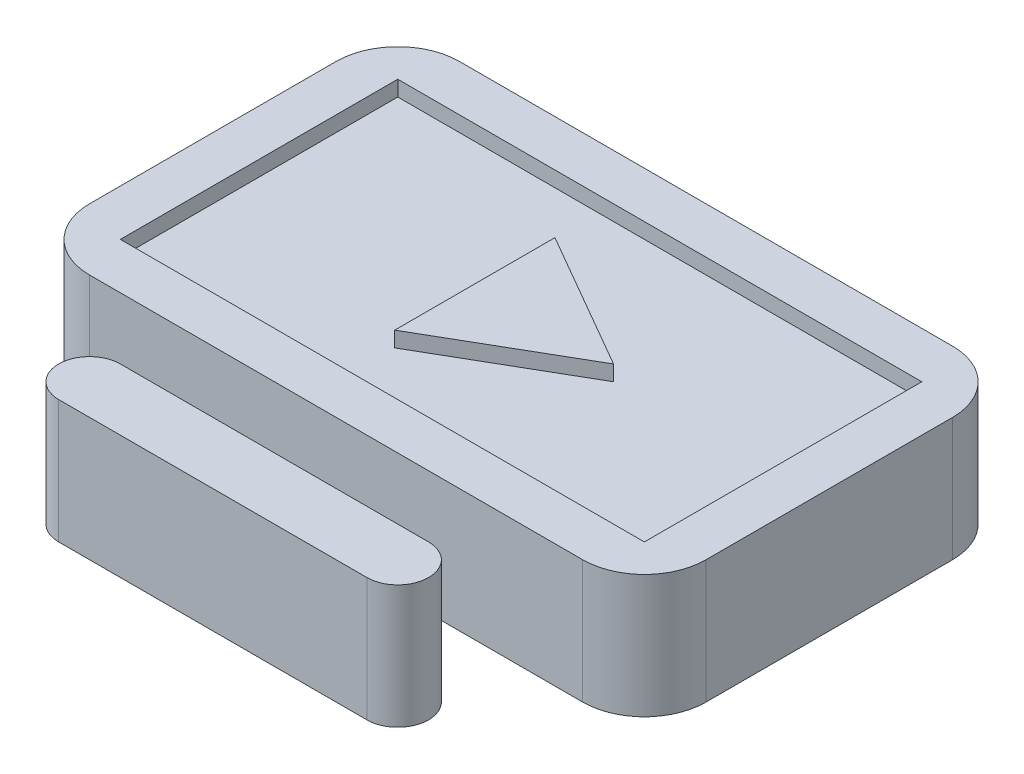
ISO-10303-21;
HEADER;
FILE_DESCRIPTION(('STEP AP214'),'2;1');
FILE_NAME('part.step','',(''),(''),'','','');
FILE_SCHEMA(('AUTOMOTIVE_DESIGN { 1 0 10303 214 1 1 1 1 }'));
ENDSEC;
DATA;
#1=APPLICATION_CONTEXT('core data for automotive mechanical design processes');
#2=APPLICATION_PROTOCOL_DEFINITION('international standard','automotive_design',2000,#1);
#3=PRODUCT_CONTEXT('',#1,'mechanical');
#4=PRODUCT('Part','Part','',(#3));
#5=PRODUCT_RELATED_PRODUCT_CATEGORY('part','',(#4));
#6=PRODUCT_DEFINITION_FORMATION('','',#4);
#7=PRODUCT_DEFINITION_CONTEXT('part definition',#1,'design');
#8=PRODUCT_DEFINITION('design','',#6,#7);
#9=PRODUCT_DEFINITION_SHAPE('','',#8);
#10=(LENGTH_UNIT() NAMED_UNIT(*) SI_UNIT(.MILLI.,.METRE.));
#11=(NAMED_UNIT(*) PLANE_ANGLE_UNIT() SI_UNIT($,.RADIAN.));
#12=(NAMED_UNIT(*) SI_UNIT($,.STERADIAN.) SOLID_ANGLE_UNIT());
#13=UNCERTAINTY_MEASURE_WITH_UNIT(LENGTH_MEASURE(1.E-05),#10,'distance_accuracy_value','');
#14=(GEOMETRIC_REPRESENTATION_CONTEXT(3) GLOBAL_UNCERTAINTY_ASSIGNED_CONTEXT((#13)) GLOBAL_UNIT_ASSIGNED_CONTEXT((#10,
#11,#12)) REPRESENTATION_CONTEXT('',''));
#15=CARTESIAN_POINT('',(0.,0.,0.));
#16=DIRECTION('',(0.,0.,1.));
#17=DIRECTION('',(1.,0.,0.));
#18=AXIS2_PLACEMENT_3D('',#15,#16,#17);
#19=CARTESIAN_POINT('',(-12.7,50.8,0.));
#20=DIRECTION('',(-1.,0.,0.));
#21=DIRECTION('',(0.,0.,1.));
#22=AXIS2_PLACEMENT_3D('',#19,#20,#21);
#23=PLANE('',#22);
#24=DIRECTION('',(0.,-1.,0.));
#25=VECTOR('',#24,1.);
#26=CARTESIAN_POINT('',(-12.7,50.8,-12.7));
#27=LINE('',#26,#25);
#28=CARTESIAN_POINT('',(-12.7,25.4,-12.7));
#29=VERTEX_POINT('',#28);
#30=CARTESIAN_POINT('',(-12.7,0.,-12.7));
#31=VERTEX_POINT('',#30);
#32=EDGE_CURVE('E190',#29,#31,#27,.T.);
#33=ORIENTED_EDGE('',*,*,#32,.F.);
#34=DIRECTION('',(0.,0.,1.));
#35=VECTOR('',#34,1.);
#36=CARTESIAN_POINT('',(-12.7,25.4,-38.1));
#37=LINE('',#36,#35);
#38=CARTESIAN_POINT('',(-12.7,25.4,-38.1));
#39=VERTEX_POINT('',#38);
#40=EDGE_CURVE('E196',#39,#29,#37,.T.);
#41=ORIENTED_EDGE('',*,*,#40,.F.);
#42=DIRECTION('',(0.,-1.,0.));
#43=VECTOR('',#42,1.);
#44=CARTESIAN_POINT('',(-12.7,50.8,-38.1));
#45=LINE('',#44,#43);
#46=CARTESIAN_POINT('',(-12.7,0.,-38.1));
#47=VERTEX_POINT('',#46);
#48=EDGE_CURVE('E208',#39,#47,#45,.T.);
#49=ORIENTED_EDGE('',*,*,#48,.T.);
#50=DIRECTION('',(0.,0.,-1.));
#51=VECTOR('',#50,1.);
#52=CARTESIAN_POINT('',(-12.7,0.,0.));
#53=LINE('',#52,#51);
#54=EDGE_CURVE('E206',#31,#47,#53,.T.);
#55=ORIENTED_EDGE('',*,*,#54,.F.);
#56=EDGE_LOOP('',(#33,#41,#49,#55));
#57=FACE_BOUND('',#56,.T.);
#58=ADVANCED_FACE('F32',(#57),#23,.T.);
#59=CARTESIAN_POINT('',(12.7,50.8,0.));
#60=DIRECTION('',(-1.,0.,0.));
#61=DIRECTION('',(0.,0.,1.));
#62=AXIS2_PLACEMENT_3D('',#59,#60,#61);
#63=PLANE('',#62);
#64=DIRECTION('',(0.,0.,-1.));
#65=VECTOR('',#64,1.);
#66=CARTESIAN_POINT('',(12.7,25.4,-38.1));
#67=LINE('',#66,#65);
#68=CARTESIAN_POINT('',(12.7,25.4,-12.7));
#69=VERTEX_POINT('',#68);
#70=CARTESIAN_POINT('',(12.7,25.4,-38.1));
#71=VERTEX_POINT('',#70);
#72=EDGE_CURVE('E195',#69,#71,#67,.T.);
#73=ORIENTED_EDGE('',*,*,#72,.F.);
#74=DIRECTION('',(0.,-1.,0.));
#75=VECTOR('',#74,1.);
#76=CARTESIAN_POINT('',(12.7,50.8,-12.7));
#77=LINE('',#76,#75);
#78=CARTESIAN_POINT('',(12.7,0.,-12.7));
#79=VERTEX_POINT('',#78);
#80=EDGE_CURVE('E192',#69,#79,#77,.T.);
#81=ORIENTED_EDGE('',*,*,#80,.T.);
#82=DIRECTION('',(0.,0.,-1.));
#83=VECTOR('',#82,1.);
#84=CARTESIAN_POINT('',(12.7,0.,0.));
#85=LINE('',#84,#83);
#86=CARTESIAN_POINT('',(12.7,0.,-38.1));
#87=VERTEX_POINT('',#86);
#88=EDGE_CURVE('E289',#79,#87,#85,.T.);
#89=ORIENTED_EDGE('',*,*,#88,.T.);
#90=DIRECTION('',(0.,-1.,0.));
#91=VECTOR('',#90,1.);
#92=CARTESIAN_POINT('',(12.7,50.8,-38.1));
#93=LINE('',#92,#91);
#94=EDGE_CURVE('E292',#71,#87,#93,.T.);
#95=ORIENTED_EDGE('',*,*,#94,.F.);
#96=EDGE_LOOP('',(#73,#81,#89,#95));
#97=FACE_BOUND('',#96,.T.);
#98=ADVANCED_FACE('F395',(#97),#63,.F.);
#99=CARTESIAN_POINT('',(0.,50.8,0.));
#100=DIRECTION('',(0.,1.,0.));
#101=DIRECTION('',(0.,0.,1.));
#102=AXIS2_PLACEMENT_3D('',#99,#100,#101);
#103=PLANE('',#102);
#104=CARTESIAN_POINT('',(-101.6,50.8,-63.5));
#105=DIRECTION('',(0.,1.,0.));
#106=DIRECTION('',(0.,0.,1.));
#107=AXIS2_PLACEMENT_3D('',#104,#105,#106);
#108=CIRCLE('',#107,25.4);
#109=CARTESIAN_POINT('',(-127.,50.8,-63.5));
#110=VERTEX_POINT('',#109);
#111=CARTESIAN_POINT('',(-101.6,50.8,-38.1));
#112=VERTEX_POINT('',#111);
#113=EDGE_CURVE('E235',#110,#112,#108,.T.);
#114=ORIENTED_EDGE('',*,*,#113,.T.);
#115=DIRECTION('',(1.,0.,0.));
#116=VECTOR('',#115,1.);
#117=CARTESIAN_POINT('',(0.,50.8,-38.1));
#118=LINE('',#117,#116);
#119=CARTESIAN_POINT('',(101.6,50.8,-38.1));
#120=VERTEX_POINT('',#119);
#121=EDGE_CURVE('E294',#112,#120,#118,.T.);
#122=ORIENTED_EDGE('',*,*,#121,.T.);
#123=CARTESIAN_POINT('',(101.6,50.8,-63.5));
#124=DIRECTION('',(0.,1.,0.));
#125=DIRECTION('',(0.,0.,1.));
#126=AXIS2_PLACEMENT_3D('',#123,#124,#125);
#127=CIRCLE('',#126,25.4);
#128=CARTESIAN_POINT('',(127.,50.8,-63.5));
#129=VERTEX_POINT('',#128);
#130=EDGE_CURVE('E238',#120,#129,#127,.T.);
#131=ORIENTED_EDGE('',*,*,#130,.T.);
#132=DIRECTION('',(0.,0.,1.));
#133=VECTOR('',#132,1.);
#134=CARTESIAN_POINT('',(127.,50.8,0.));
#135=LINE('',#134,#133);
#136=CARTESIAN_POINT('',(127.,50.8,-165.1));
#137=VERTEX_POINT('',#136);
#138=EDGE_CURVE('E334',#137,#129,#135,.T.);
#139=ORIENTED_EDGE('',*,*,#138,.F.);
#140=CARTESIAN_POINT('',(101.6,50.8,-165.1));
#141=DIRECTION('',(0.,1.,0.));
#142=DIRECTION('',(0.,0.,1.));
#143=AXIS2_PLACEMENT_3D('',#140,#141,#142);
#144=CIRCLE('',#143,25.4);
#145=CARTESIAN_POINT('',(101.6,50.8,-190.5));
#146=VERTEX_POINT('',#145);
#147=EDGE_CURVE('E231',#137,#146,#144,.T.);
#148=ORIENTED_EDGE('',*,*,#147,.T.);
#149=DIRECTION('',(1.,0.,0.));
#150=VECTOR('',#149,1.);
#151=CARTESIAN_POINT('',(1.04083408558608E-13,50.8,-190.5));
#152=LINE('',#151,#150);
#153=CARTESIAN_POINT('',(-101.6,50.8,-190.5));
#154=VERTEX_POINT('',#153);
#155=EDGE_CURVE('E257',#154,#146,#152,.T.);
#156=ORIENTED_EDGE('',*,*,#155,.F.);
#157=CARTESIAN_POINT('',(-101.6,50.8,-165.1));
#158=DIRECTION('',(0.,1.,0.));
#159=DIRECTION('',(0.,0.,1.));
#160=AXIS2_PLACEMENT_3D('',#157,#158,#159);
#161=CIRCLE('',#160,25.4);
#162=CARTESIAN_POINT('',(-127.,50.8,-165.1));
#163=VERTEX_POINT('',#162);
#164=EDGE_CURVE('E233',#154,#163,#161,.T.);
#165=ORIENTED_EDGE('',*,*,#164,.T.);
#166=DIRECTION('',(0.,0.,1.));
#167=VECTOR('',#166,1.);
#168=CARTESIAN_POINT('',(-127.,50.8,0.));
#169=LINE('',#168,#167);
#170=EDGE_CURVE('E329',#163,#110,#169,.T.);
#171=ORIENTED_EDGE('',*,*,#170,.T.);
#172=EDGE_LOOP('',(#114,#122,#131,#139,#148,#156,#165,#171));
#173=FACE_BOUND('',#172,.T.);
#174=DIRECTION('',(0.,0.,-1.));
#175=VECTOR('',#174,1.);
#176=CARTESIAN_POINT('',(107.95,50.8,-57.1499999999999));
#177=LINE('',#176,#175);
#178=CARTESIAN_POINT('',(107.95,50.8,-57.1499999999999));
#179=VERTEX_POINT('',#178);
#180=CARTESIAN_POINT('',(107.95,50.8,-171.45));
#181=VERTEX_POINT('',#180);
#182=EDGE_CURVE('E356',#179,#181,#177,.T.);
#183=ORIENTED_EDGE('',*,*,#182,.F.);
#184=DIRECTION('',(1.,0.,0.));
#185=VECTOR('',#184,1.);
#186=CARTESIAN_POINT('',(-107.95,50.8,-57.1499999999999));
#187=LINE('',#186,#185);
#188=CARTESIAN_POINT('',(-107.95,50.8,-57.1499999999999));
#189=VERTEX_POINT('',#188);
#190=EDGE_CURVE('E346',#189,#179,#187,.T.);
#191=ORIENTED_EDGE('',*,*,#190,.F.);
#192=DIRECTION('',(0.,0.,1.));
#193=VECTOR('',#192,1.);
#194=CARTESIAN_POINT('',(-107.95,50.8,-57.1499999999999));
#195=LINE('',#194,#193);
#196=CARTESIAN_POINT('',(-107.95,50.8,-171.45));
#197=VERTEX_POINT('',#196);
#198=EDGE_CURVE('E350',#197,#189,#195,.T.);
#199=ORIENTED_EDGE('',*,*,#198,.F.);
#200=DIRECTION('',(-1.,0.,0.));
#201=VECTOR('',#200,1.);
#202=CARTESIAN_POINT('',(-107.95,50.8,-171.45));
#203=LINE('',#202,#201);
#204=EDGE_CURVE('E353',#181,#197,#203,.T.);
#205=ORIENTED_EDGE('',*,*,#204,.F.);
#206=EDGE_LOOP('',(#183,#191,#199,#205));
#207=FACE_BOUND('',#206,.T.);
#208=ADVANCED_FACE('F404',(#173,#207),#103,.T.);
#209=CARTESIAN_POINT('',(0.,44.45,0.));
#210=DIRECTION('',(0.,-1.,0.));
#211=DIRECTION('',(0.,0.,-1.));
#212=AXIS2_PLACEMENT_3D('',#209,#210,#211);
#213=PLANE('',#212);
#214=DIRECTION('',(0.,0.,-1.));
#215=VECTOR('',#214,1.);
#216=CARTESIAN_POINT('',(107.95,44.45,-57.1499999999999));
#217=LINE('',#216,#215);
#218=CARTESIAN_POINT('',(107.95,44.45,-57.1499999999999));
#219=VERTEX_POINT('',#218);
#220=CARTESIAN_POINT('',(107.95,44.45,-171.45));
#221=VERTEX_POINT('',#220);
#222=EDGE_CURVE('E349',#219,#221,#217,.T.);
#223=ORIENTED_EDGE('',*,*,#222,.T.);
#224=DIRECTION('',(-1.,0.,0.));
#225=VECTOR('',#224,1.);
#226=CARTESIAN_POINT('',(-107.95,44.45,-171.45));
#227=LINE('',#226,#225);
#228=CARTESIAN_POINT('',(-107.95,44.45,-171.45));
#229=VERTEX_POINT('',#228);
#230=EDGE_CURVE('E364',#221,#229,#227,.T.);
#231=ORIENTED_EDGE('',*,*,#230,.T.);
#232=DIRECTION('',(0.,0.,1.));
#233=VECTOR('',#232,1.);
#234=CARTESIAN_POINT('',(-107.95,44.45,-57.1499999999999));
#235=LINE('',#234,#233);
#236=CARTESIAN_POINT('',(-107.95,44.45,-57.1499999999999));
#237=VERTEX_POINT('',#236);
#238=EDGE_CURVE('E361',#229,#237,#235,.T.);
#239=ORIENTED_EDGE('',*,*,#238,.T.);
#240=DIRECTION('',(1.,0.,0.));
#241=VECTOR('',#240,1.);
#242=CARTESIAN_POINT('',(-107.95,44.45,-57.1499999999999));
#243=LINE('',#242,#241);
#244=EDGE_CURVE('E341',#237,#219,#243,.T.);
#245=ORIENTED_EDGE('',*,*,#244,.T.);
#246=EDGE_LOOP('',(#223,#231,#239,#245));
#247=FACE_BOUND('',#246,.T.);
#248=DIRECTION('',(0.866025403784438,0.,-0.500000000000001));
#249=VECTOR('',#248,1.);
#250=CARTESIAN_POINT('',(-19.05,44.45,-81.3044321158129));
#251=LINE('',#250,#249);
#252=CARTESIAN_POINT('',(-19.05,44.45,-81.3044321158129));
#253=VERTEX_POINT('',#252);
#254=CARTESIAN_POINT('',(38.1,44.45,-114.3));
#255=VERTEX_POINT('',#254);
#256=EDGE_CURVE('E372',#253,#255,#251,.T.);
#257=ORIENTED_EDGE('',*,*,#256,.F.);
#258=DIRECTION('',(0.,0.,1.));
#259=VECTOR('',#258,1.);
#260=CARTESIAN_POINT('',(-19.05,44.45,-147.295567884187));
#261=LINE('',#260,#259);
#262=CARTESIAN_POINT('',(-19.05,44.45,-147.295567884187));
#263=VERTEX_POINT('',#262);
#264=EDGE_CURVE('E51',#263,#253,#261,.T.);
#265=ORIENTED_EDGE('',*,*,#264,.F.);
#266=DIRECTION('',(-0.866025403784439,0.,-0.5));
#267=VECTOR('',#266,1.);
#268=CARTESIAN_POINT('',(38.1,44.45,-114.3));
#269=LINE('',#268,#267);
#270=EDGE_CURVE('E47',#255,#263,#269,.T.);
#271=ORIENTED_EDGE('',*,*,#270,.F.);
#272=EDGE_LOOP('',(#257,#265,#271));
#273=FACE_BOUND('',#272,.T.);
#274=ADVANCED_FACE('F434',(#247,#273),#213,.F.);
#275=CARTESIAN_POINT('',(127.,50.8,0.));
#276=DIRECTION('',(1.,0.,0.));
#277=DIRECTION('',(0.,0.,-1.));
#278=AXIS2_PLACEMENT_3D('',#275,#276,#277);
#279=PLANE('',#278);
#280=ORIENTED_EDGE('',*,*,#138,.T.);
#281=DIRECTION('',(0.,-1.,0.));
#282=VECTOR('',#281,1.);
#283=CARTESIAN_POINT('',(127.,0.,-63.5));
#284=LINE('',#283,#282);
#285=CARTESIAN_POINT('',(127.,0.,-63.5));
#286=VERTEX_POINT('',#285);
#287=EDGE_CURVE('E218',#129,#286,#284,.T.);
#288=ORIENTED_EDGE('',*,*,#287,.T.);
#289=DIRECTION('',(0.,0.,1.));
#290=VECTOR('',#289,1.);
#291=CARTESIAN_POINT('',(127.,0.,0.));
#292=LINE('',#291,#290);
#293=CARTESIAN_POINT('',(127.,0.,-165.1));
#294=VERTEX_POINT('',#293);
#295=EDGE_CURVE('E266',#294,#286,#292,.T.);
#296=ORIENTED_EDGE('',*,*,#295,.F.);
#297=DIRECTION('',(0.,-1.,0.));
#298=VECTOR('',#297,1.);
#299=CARTESIAN_POINT('',(127.,50.8,-165.1));
#300=LINE('',#299,#298);
#301=EDGE_CURVE('E211',#294,#137,#300,.F.);
#302=ORIENTED_EDGE('',*,*,#301,.T.);
#303=EDGE_LOOP('',(#280,#288,#296,#302));
#304=FACE_BOUND('',#303,.T.);
#305=ADVANCED_FACE('F407',(#304),#279,.T.);
#306=CARTESIAN_POINT('',(1.04083408558608E-13,50.8,-190.5));
#307=DIRECTION('',(0.,0.,-1.));
#308=DIRECTION('',(-1.,0.,0.));
#309=AXIS2_PLACEMENT_3D('',#306,#307,#308);
#310=PLANE('',#309);
#311=DIRECTION('',(1.,0.,0.));
#312=VECTOR('',#311,1.);
#313=CARTESIAN_POINT('',(1.04083408558608E-13,0.,-190.5));
#314=LINE('',#313,#312);
#315=CARTESIAN_POINT('',(-101.6,0.,-190.5));
#316=VERTEX_POINT('',#315);
#317=CARTESIAN_POINT('',(101.6,0.,-190.5));
#318=VERTEX_POINT('',#317);
#319=EDGE_CURVE('E254',#316,#318,#314,.T.);
#320=ORIENTED_EDGE('',*,*,#319,.F.);
#321=DIRECTION('',(0.,-1.,0.));
#322=VECTOR('',#321,1.);
#323=CARTESIAN_POINT('',(-101.6,50.8,-190.5));
#324=LINE('',#323,#322);
#325=EDGE_CURVE('E11',#316,#154,#324,.F.);
#326=ORIENTED_EDGE('',*,*,#325,.T.);
#327=ORIENTED_EDGE('',*,*,#155,.T.);
#328=DIRECTION('',(0.,-1.,0.));
#329=VECTOR('',#328,1.);
#330=CARTESIAN_POINT('',(101.6,50.8,-190.5));
#331=LINE('',#330,#329);
#332=EDGE_CURVE('E40',#146,#318,#331,.T.);
#333=ORIENTED_EDGE('',*,*,#332,.T.);
#334=EDGE_LOOP('',(#320,#326,#327,#333));
#335=FACE_BOUND('',#334,.T.);
#336=ADVANCED_FACE('F253',(#335),#310,.T.);
#337=CARTESIAN_POINT('',(-127.,50.8,0.));
#338=DIRECTION('',(1.,0.,0.));
#339=DIRECTION('',(0.,0.,-1.));
#340=AXIS2_PLACEMENT_3D('',#337,#338,#339);
#341=PLANE('',#340);
#342=DIRECTION('',(0.,0.,1.));
#343=VECTOR('',#342,1.);
#344=CARTESIAN_POINT('',(-127.,0.,0.));
#345=LINE('',#344,#343);
#346=CARTESIAN_POINT('',(-127.,0.,-165.1));
#347=VERTEX_POINT('',#346);
#348=CARTESIAN_POINT('',(-127.,0.,-63.5));
#349=VERTEX_POINT('',#348);
#350=EDGE_CURVE('E265',#347,#349,#345,.T.);
#351=ORIENTED_EDGE('',*,*,#350,.T.);
#352=DIRECTION('',(0.,-1.,0.));
#353=VECTOR('',#352,1.);
#354=CARTESIAN_POINT('',(-127.,50.8,-63.5));
#355=LINE('',#354,#353);
#356=EDGE_CURVE('E246',#349,#110,#355,.F.);
#357=ORIENTED_EDGE('',*,*,#356,.T.);
#358=ORIENTED_EDGE('',*,*,#170,.F.);
#359=DIRECTION('',(0.,-1.,0.));
#360=VECTOR('',#359,1.);
#361=CARTESIAN_POINT('',(-127.,0.,-165.1));
#362=LINE('',#361,#360);
#363=EDGE_CURVE('E243',#163,#347,#362,.T.);
#364=ORIENTED_EDGE('',*,*,#363,.T.);
#365=EDGE_LOOP('',(#351,#357,#358,#364));
#366=FACE_BOUND('',#365,.T.);
#367=ADVANCED_FACE('F415',(#366),#341,.F.);
#368=CARTESIAN_POINT('',(-63.5,50.8,0.));
#369=DIRECTION('',(0.,-1.,0.));
#370=DIRECTION('',(0.,0.,-1.));
#371=AXIS2_PLACEMENT_3D('',#368,#369,#370);
#372=CYLINDRICAL_SURFACE('',#371,12.7);
#373=CARTESIAN_POINT('',(-63.5,0.,0.));
#374=DIRECTION('',(0.,1.,0.));
#375=DIRECTION('',(0.,0.,1.));
#376=AXIS2_PLACEMENT_3D('',#373,#374,#375);
#377=CIRCLE('',#376,12.7);
#378=CARTESIAN_POINT('',(-63.5,0.,-12.7));
#379=VERTEX_POINT('',#378);
#380=CARTESIAN_POINT('',(-63.5,0.,12.7));
#381=VERTEX_POINT('',#380);
#382=EDGE_CURVE('E281',#379,#381,#377,.T.);
#383=ORIENTED_EDGE('',*,*,#382,.T.);
#384=DIRECTION('',(0.,-1.,0.));
#385=VECTOR('',#384,1.);
#386=CARTESIAN_POINT('',(-63.5,50.8,12.7));
#387=LINE('',#386,#385);
#388=CARTESIAN_POINT('',(-63.5,50.8,12.7));
#389=VERTEX_POINT('',#388);
#390=EDGE_CURVE('E213',#389,#381,#387,.T.);
#391=ORIENTED_EDGE('',*,*,#390,.F.);
#392=CARTESIAN_POINT('',(-63.5,50.8,0.));
#393=DIRECTION('',(0.,1.,0.));
#394=DIRECTION('',(0.,0.,1.));
#395=AXIS2_PLACEMENT_3D('',#392,#393,#394);
#396=CIRCLE('',#395,12.7);
#397=CARTESIAN_POINT('',(-63.5,50.8,-12.7));
#398=VERTEX_POINT('',#397);
#399=EDGE_CURVE('E324',#398,#389,#396,.T.);
#400=ORIENTED_EDGE('',*,*,#399,.F.);
#401=DIRECTION('',(0.,-1.,0.));
#402=VECTOR('',#401,1.);
#403=CARTESIAN_POINT('',(-63.5,50.8,-12.7));
#404=LINE('',#403,#402);
#405=EDGE_CURVE('E209',#398,#379,#404,.T.);
#406=ORIENTED_EDGE('',*,*,#405,.T.);
#407=EDGE_LOOP('',(#383,#391,#400,#406));
#408=FACE_BOUND('',#407,.T.);
#409=ADVANCED_FACE('F422',(#408),#372,.T.);
#410=CARTESIAN_POINT('',(0.,50.8,12.7));
#411=DIRECTION('',(0.,0.,-1.));
#412=DIRECTION('',(-1.,0.,0.));
#413=AXIS2_PLACEMENT_3D('',#410,#411,#412);
#414=PLANE('',#413);
#415=DIRECTION('',(1.,0.,0.));
#416=VECTOR('',#415,1.);
#417=CARTESIAN_POINT('',(0.,0.,12.7));
#418=LINE('',#417,#416);
#419=CARTESIAN_POINT('',(63.5,0.,12.7));
#420=VERTEX_POINT('',#419);
#421=EDGE_CURVE('E284',#381,#420,#418,.T.);
#422=ORIENTED_EDGE('',*,*,#421,.T.);
#423=DIRECTION('',(0.,-1.,0.));
#424=VECTOR('',#423,1.);
#425=CARTESIAN_POINT('',(63.5,50.8,12.7));
#426=LINE('',#425,#424);
#427=CARTESIAN_POINT('',(63.5,50.8,12.7));
#428=VERTEX_POINT('',#427);
#429=EDGE_CURVE('E298',#428,#420,#426,.T.);
#430=ORIENTED_EDGE('',*,*,#429,.F.);
#431=DIRECTION('',(1.,0.,0.));
#432=VECTOR('',#431,1.);
#433=CARTESIAN_POINT('',(0.,50.8,12.7));
#434=LINE('',#433,#432);
#435=EDGE_CURVE('E307',#389,#428,#434,.T.);
#436=ORIENTED_EDGE('',*,*,#435,.F.);
#437=ORIENTED_EDGE('',*,*,#390,.T.);
#438=EDGE_LOOP('',(#422,#430,#436,#437));
#439=FACE_BOUND('',#438,.T.);
#440=ADVANCED_FACE('F305',(#439),#414,.F.);
#441=CARTESIAN_POINT('',(63.5,50.8,0.));
#442=DIRECTION('',(0.,-1.,0.));
#443=DIRECTION('',(0.,0.,-1.));
#444=AXIS2_PLACEMENT_3D('',#441,#442,#443);
#445=CYLINDRICAL_SURFACE('',#444,12.7);
#446=CARTESIAN_POINT('',(63.5,0.,0.));
#447=DIRECTION('',(0.,1.,0.));
#448=DIRECTION('',(0.,0.,1.));
#449=AXIS2_PLACEMENT_3D('',#446,#447,#448);
#450=CIRCLE('',#449,12.7);
#451=CARTESIAN_POINT('',(63.5,0.,-12.7));
#452=VERTEX_POINT('',#451);
#453=EDGE_CURVE('E286',#420,#452,#450,.T.);
#454=ORIENTED_EDGE('',*,*,#453,.T.);
#455=DIRECTION('',(0.,-1.,0.));
#456=VECTOR('',#455,1.);
#457=CARTESIAN_POINT('',(63.5,50.8,-12.7));
#458=LINE('',#457,#456);
#459=CARTESIAN_POINT('',(63.5,50.8,-12.7));
#460=VERTEX_POINT('',#459);
#461=EDGE_CURVE('E296',#460,#452,#458,.T.);
#462=ORIENTED_EDGE('',*,*,#461,.F.);
#463=CARTESIAN_POINT('',(63.5,50.8,0.));
#464=DIRECTION('',(0.,1.,0.));
#465=DIRECTION('',(0.,0.,1.));
#466=AXIS2_PLACEMENT_3D('',#463,#464,#465);
#467=CIRCLE('',#466,12.7);
#468=EDGE_CURVE('E319',#428,#460,#467,.T.);
#469=ORIENTED_EDGE('',*,*,#468,.F.);
#470=ORIENTED_EDGE('',*,*,#429,.T.);
#471=EDGE_LOOP('',(#454,#462,#469,#470));
#472=FACE_BOUND('',#471,.T.);
#473=ADVANCED_FACE('F316',(#472),#445,.T.);
#474=CARTESIAN_POINT('',(0.,50.8,-12.7));
#475=DIRECTION('',(0.,0.,-1.));
#476=DIRECTION('',(-1.,0.,0.));
#477=AXIS2_PLACEMENT_3D('',#474,#475,#476);
#478=PLANE('',#477);
#479=DIRECTION('',(1.,0.,0.));
#480=VECTOR('',#479,1.);
#481=CARTESIAN_POINT('',(0.,0.,-12.7));
#482=LINE('',#481,#480);
#483=EDGE_CURVE('E282',#79,#452,#482,.T.);
#484=ORIENTED_EDGE('',*,*,#483,.F.);
#485=ORIENTED_EDGE('',*,*,#80,.F.);
#486=DIRECTION('',(1.,0.,0.));
#487=VECTOR('',#486,1.);
#488=CARTESIAN_POINT('',(-12.7,25.4,-12.7));
#489=LINE('',#488,#487);
#490=EDGE_CURVE('E184',#29,#69,#489,.T.);
#491=ORIENTED_EDGE('',*,*,#490,.F.);
#492=ORIENTED_EDGE('',*,*,#32,.T.);
#493=EDGE_CURVE('E279',#379,#31,#482,.T.);
#494=ORIENTED_EDGE('',*,*,#493,.F.);
#495=ORIENTED_EDGE('',*,*,#405,.F.);
#496=DIRECTION('',(1.,0.,0.));
#497=VECTOR('',#496,1.);
#498=CARTESIAN_POINT('',(0.,50.8,-12.7));
#499=LINE('',#498,#497);
#500=EDGE_CURVE('E328',#398,#460,#499,.T.);
#501=ORIENTED_EDGE('',*,*,#500,.T.);
#502=ORIENTED_EDGE('',*,*,#461,.T.);
#503=EDGE_LOOP('',(#484,#485,#491,#492,#494,#495,#501,#502));
#504=FACE_BOUND('',#503,.T.);
#505=ADVANCED_FACE('F187',(#504),#478,.T.);
#506=CARTESIAN_POINT('',(0.,50.8,-38.1));
#507=DIRECTION('',(0.,0.,-1.));
#508=DIRECTION('',(-1.,0.,0.));
#509=AXIS2_PLACEMENT_3D('',#506,#507,#508);
#510=PLANE('',#509);
#511=DIRECTION('',(1.,0.,0.));
#512=VECTOR('',#511,1.);
#513=CARTESIAN_POINT('',(0.,0.,-38.1));
#514=LINE('',#513,#512);
#515=CARTESIAN_POINT('',(101.6,0.,-38.1));
#516=VERTEX_POINT('',#515);
#517=EDGE_CURVE('E277',#87,#516,#514,.T.);
#518=ORIENTED_EDGE('',*,*,#517,.T.);
#519=DIRECTION('',(0.,-1.,0.));
#520=VECTOR('',#519,1.);
#521=CARTESIAN_POINT('',(101.6,50.8,-38.1));
#522=LINE('',#521,#520);
#523=EDGE_CURVE('E229',#516,#120,#522,.F.);
#524=ORIENTED_EDGE('',*,*,#523,.T.);
#525=ORIENTED_EDGE('',*,*,#121,.F.);
#526=DIRECTION('',(0.,-1.,0.));
#527=VECTOR('',#526,1.);
#528=CARTESIAN_POINT('',(-101.6,50.8,-38.1));
#529=LINE('',#528,#527);
#530=CARTESIAN_POINT('',(-101.6,0.,-38.1));
#531=VERTEX_POINT('',#530);
#532=EDGE_CURVE('E240',#112,#531,#529,.T.);
#533=ORIENTED_EDGE('',*,*,#532,.T.);
#534=EDGE_CURVE('E269',#531,#47,#514,.T.);
#535=ORIENTED_EDGE('',*,*,#534,.T.);
#536=ORIENTED_EDGE('',*,*,#48,.F.);
#537=DIRECTION('',(-1.,0.,0.));
#538=VECTOR('',#537,1.);
#539=CARTESIAN_POINT('',(-12.7,25.4,-38.1));
#540=LINE('',#539,#538);
#541=EDGE_CURVE('E201',#71,#39,#540,.T.);
#542=ORIENTED_EDGE('',*,*,#541,.F.);
#543=ORIENTED_EDGE('',*,*,#94,.T.);
#544=EDGE_LOOP('',(#518,#524,#525,#533,#535,#536,#542,#543));
#545=FACE_BOUND('',#544,.T.);
#546=ADVANCED_FACE('F394',(#545),#510,.F.);
#547=ORIENTED_EDGE('',*,*,#468,.T.);
#548=ORIENTED_EDGE('',*,*,#500,.F.);
#549=ORIENTED_EDGE('',*,*,#399,.T.);
#550=ORIENTED_EDGE('',*,*,#435,.T.);
#551=EDGE_LOOP('',(#547,#548,#549,#550));
#552=FACE_BOUND('',#551,.T.);
#553=ADVANCED_FACE('F423',(#552),#103,.T.);
#554=CARTESIAN_POINT('',(0.,0.,0.));
#555=DIRECTION('',(0.,1.,0.));
#556=DIRECTION('',(0.,0.,1.));
#557=AXIS2_PLACEMENT_3D('',#554,#555,#556);
#558=PLANE('',#557);
#559=ORIENTED_EDGE('',*,*,#295,.T.);
#560=CARTESIAN_POINT('',(101.6,0.,-63.5));
#561=DIRECTION('',(0.,1.,0.));
#562=DIRECTION('',(0.,0.,1.));
#563=AXIS2_PLACEMENT_3D('',#560,#561,#562);
#564=CIRCLE('',#563,25.4);
#565=EDGE_CURVE('E227',#286,#516,#564,.F.);
#566=ORIENTED_EDGE('',*,*,#565,.T.);
#567=ORIENTED_EDGE('',*,*,#517,.F.);
#568=ORIENTED_EDGE('',*,*,#88,.F.);
#569=ORIENTED_EDGE('',*,*,#483,.T.);
#570=ORIENTED_EDGE('',*,*,#453,.F.);
#571=ORIENTED_EDGE('',*,*,#421,.F.);
#572=ORIENTED_EDGE('',*,*,#382,.F.);
#573=ORIENTED_EDGE('',*,*,#493,.T.);
#574=ORIENTED_EDGE('',*,*,#54,.T.);
#575=ORIENTED_EDGE('',*,*,#534,.F.);
#576=CARTESIAN_POINT('',(-101.6,0.,-63.5));
#577=DIRECTION('',(0.,1.,0.));
#578=DIRECTION('',(0.,0.,1.));
#579=AXIS2_PLACEMENT_3D('',#576,#577,#578);
#580=CIRCLE('',#579,25.4);
#581=EDGE_CURVE('E225',#531,#349,#580,.F.);
#582=ORIENTED_EDGE('',*,*,#581,.T.);
#583=ORIENTED_EDGE('',*,*,#350,.F.);
#584=CARTESIAN_POINT('',(-101.6,0.,-165.1));
#585=DIRECTION('',(0.,1.,0.));
#586=DIRECTION('',(0.,0.,1.));
#587=AXIS2_PLACEMENT_3D('',#584,#585,#586);
#588=CIRCLE('',#587,25.4);
#589=EDGE_CURVE('E223',#347,#316,#588,.F.);
#590=ORIENTED_EDGE('',*,*,#589,.T.);
#591=ORIENTED_EDGE('',*,*,#319,.T.);
#592=CARTESIAN_POINT('',(101.6,0.,-165.1));
#593=DIRECTION('',(0.,1.,0.));
#594=DIRECTION('',(0.,0.,1.));
#595=AXIS2_PLACEMENT_3D('',#592,#593,#594);
#596=CIRCLE('',#595,25.4);
#597=EDGE_CURVE('E221',#318,#294,#596,.F.);
#598=ORIENTED_EDGE('',*,*,#597,.T.);
#599=EDGE_LOOP('',(#559,#566,#567,#568,#569,#570,#571,#572,#573,#574,#575,#582,#583,#590,#591,#598));
#600=FACE_BOUND('',#599,.T.);
#601=ADVANCED_FACE('F262',(#600),#558,.F.);
#602=CARTESIAN_POINT('',(101.6,50.8,-63.5));
#603=DIRECTION('',(0.,1.,0.));
#604=DIRECTION('',(0.,0.,1.));
#605=AXIS2_PLACEMENT_3D('',#602,#603,#604);
#606=CYLINDRICAL_SURFACE('',#605,25.4);
#607=ORIENTED_EDGE('',*,*,#130,.F.);
#608=ORIENTED_EDGE('',*,*,#523,.F.);
#609=ORIENTED_EDGE('',*,*,#565,.F.);
#610=ORIENTED_EDGE('',*,*,#287,.F.);
#611=EDGE_LOOP('',(#607,#608,#609,#610));
#612=FACE_BOUND('',#611,.T.);
#613=ADVANCED_FACE('F400',(#612),#606,.T.);
#614=CARTESIAN_POINT('',(-101.6,50.8,-63.5));
#615=DIRECTION('',(0.,-1.,0.));
#616=DIRECTION('',(0.,0.,-1.));
#617=AXIS2_PLACEMENT_3D('',#614,#615,#616);
#618=CYLINDRICAL_SURFACE('',#617,25.4);
#619=ORIENTED_EDGE('',*,*,#113,.F.);
#620=ORIENTED_EDGE('',*,*,#356,.F.);
#621=ORIENTED_EDGE('',*,*,#581,.F.);
#622=ORIENTED_EDGE('',*,*,#532,.F.);
#623=EDGE_LOOP('',(#619,#620,#621,#622));
#624=FACE_BOUND('',#623,.T.);
#625=ADVANCED_FACE('F421',(#624),#618,.T.);
#626=CARTESIAN_POINT('',(-101.6,50.8,-165.1));
#627=DIRECTION('',(0.,1.,0.));
#628=DIRECTION('',(0.,0.,1.));
#629=AXIS2_PLACEMENT_3D('',#626,#627,#628);
#630=CYLINDRICAL_SURFACE('',#629,25.4);
#631=ORIENTED_EDGE('',*,*,#164,.F.);
#632=ORIENTED_EDGE('',*,*,#325,.F.);
#633=ORIENTED_EDGE('',*,*,#589,.F.);
#634=ORIENTED_EDGE('',*,*,#363,.F.);
#635=EDGE_LOOP('',(#631,#632,#633,#634));
#636=FACE_BOUND('',#635,.T.);
#637=ADVANCED_FACE('F413',(#636),#630,.T.);
#638=CARTESIAN_POINT('',(101.6,50.8,-165.1));
#639=DIRECTION('',(0.,-1.,0.));
#640=DIRECTION('',(0.,0.,-1.));
#641=AXIS2_PLACEMENT_3D('',#638,#639,#640);
#642=CYLINDRICAL_SURFACE('',#641,25.4);
#643=ORIENTED_EDGE('',*,*,#147,.F.);
#644=ORIENTED_EDGE('',*,*,#301,.F.);
#645=ORIENTED_EDGE('',*,*,#597,.F.);
#646=ORIENTED_EDGE('',*,*,#332,.F.);
#647=EDGE_LOOP('',(#643,#644,#645,#646));
#648=FACE_BOUND('',#647,.T.);
#649=ADVANCED_FACE('F34',(#648),#642,.T.);
#650=CARTESIAN_POINT('',(107.95,44.45,-57.1499999999999));
#651=DIRECTION('',(1.,0.,0.));
#652=DIRECTION('',(0.,0.,-1.));
#653=AXIS2_PLACEMENT_3D('',#650,#651,#652);
#654=PLANE('',#653);
#655=ORIENTED_EDGE('',*,*,#182,.T.);
#656=DIRECTION('',(0.,1.,0.));
#657=VECTOR('',#656,1.);
#658=CARTESIAN_POINT('',(107.95,44.45,-171.45));
#659=LINE('',#658,#657);
#660=EDGE_CURVE('E337',#221,#181,#659,.T.);
#661=ORIENTED_EDGE('',*,*,#660,.F.);
#662=ORIENTED_EDGE('',*,*,#222,.F.);
#663=DIRECTION('',(0.,1.,0.));
#664=VECTOR('',#663,1.);
#665=CARTESIAN_POINT('',(107.95,44.45,-57.1499999999999));
#666=LINE('',#665,#664);
#667=EDGE_CURVE('E271',#219,#179,#666,.T.);
#668=ORIENTED_EDGE('',*,*,#667,.T.);
#669=EDGE_LOOP('',(#655,#661,#662,#668));
#670=FACE_BOUND('',#669,.T.);
#671=ADVANCED_FACE('F457',(#670),#654,.F.);
#672=CARTESIAN_POINT('',(-107.95,44.45,-57.1499999999999));
#673=DIRECTION('',(0.,0.,1.));
#674=DIRECTION('',(1.,0.,0.));
#675=AXIS2_PLACEMENT_3D('',#672,#673,#674);
#676=PLANE('',#675);
#677=ORIENTED_EDGE('',*,*,#190,.T.);
#678=ORIENTED_EDGE('',*,*,#667,.F.);
#679=ORIENTED_EDGE('',*,*,#244,.F.);
#680=DIRECTION('',(0.,1.,0.));
#681=VECTOR('',#680,1.);
#682=CARTESIAN_POINT('',(-107.95,44.45,-57.1499999999999));
#683=LINE('',#682,#681);
#684=EDGE_CURVE('E343',#237,#189,#683,.T.);
#685=ORIENTED_EDGE('',*,*,#684,.T.);
#686=EDGE_LOOP('',(#677,#678,#679,#685));
#687=FACE_BOUND('',#686,.T.);
#688=ADVANCED_FACE('F461',(#687),#676,.F.);
#689=CARTESIAN_POINT('',(-107.95,44.45,-57.1499999999999));
#690=DIRECTION('',(-1.,0.,0.));
#691=DIRECTION('',(0.,0.,1.));
#692=AXIS2_PLACEMENT_3D('',#689,#690,#691);
#693=PLANE('',#692);
#694=ORIENTED_EDGE('',*,*,#198,.T.);
#695=ORIENTED_EDGE('',*,*,#684,.F.);
#696=ORIENTED_EDGE('',*,*,#238,.F.);
#697=DIRECTION('',(0.,1.,0.));
#698=VECTOR('',#697,1.);
#699=CARTESIAN_POINT('',(-107.95,44.45,-171.45));
#700=LINE('',#699,#698);
#701=EDGE_CURVE('E340',#229,#197,#700,.T.);
#702=ORIENTED_EDGE('',*,*,#701,.T.);
#703=EDGE_LOOP('',(#694,#695,#696,#702));
#704=FACE_BOUND('',#703,.T.);
#705=ADVANCED_FACE('F466',(#704),#693,.F.);
#706=CARTESIAN_POINT('',(-107.95,44.45,-171.45));
#707=DIRECTION('',(0.,0.,-1.));
#708=DIRECTION('',(-1.,0.,0.));
#709=AXIS2_PLACEMENT_3D('',#706,#707,#708);
#710=PLANE('',#709);
#711=ORIENTED_EDGE('',*,*,#204,.T.);
#712=ORIENTED_EDGE('',*,*,#701,.F.);
#713=ORIENTED_EDGE('',*,*,#230,.F.);
#714=ORIENTED_EDGE('',*,*,#660,.T.);
#715=EDGE_LOOP('',(#711,#712,#713,#714));
#716=FACE_BOUND('',#715,.T.);
#717=ADVANCED_FACE('F470',(#716),#710,.F.);
#718=CARTESIAN_POINT('',(-19.05,138.098066988909,-81.3044321158129));
#719=DIRECTION('',(-0.500000000000001,0.,-0.866025403784438));
#720=DIRECTION('',(-0.866025403784438,0.,0.500000000000001));
#721=AXIS2_PLACEMENT_3D('',#718,#719,#720);
#722=PLANE('',#721);
#723=DIRECTION('',(0.866025403784438,0.,-0.500000000000001));
#724=VECTOR('',#723,1.);
#725=CARTESIAN_POINT('',(-19.05,50.8,-81.3044321158129));
#726=LINE('',#725,#724);
#727=CARTESIAN_POINT('',(-19.05,50.8,-81.3044321158129));
#728=VERTEX_POINT('',#727);
#729=CARTESIAN_POINT('',(38.1,50.8,-114.3));
#730=VERTEX_POINT('',#729);
#731=EDGE_CURVE('E380',#728,#730,#726,.T.);
#732=ORIENTED_EDGE('',*,*,#731,.F.);
#733=DIRECTION('',(0.,-1.,0.));
#734=VECTOR('',#733,1.);
#735=CARTESIAN_POINT('',(-19.05,138.098066988909,-81.3044321158129));
#736=LINE('',#735,#734);
#737=EDGE_CURVE('E369',#728,#253,#736,.T.);
#738=ORIENTED_EDGE('',*,*,#737,.T.);
#739=ORIENTED_EDGE('',*,*,#256,.T.);
#740=DIRECTION('',(0.,-1.,0.));
#741=VECTOR('',#740,1.);
#742=CARTESIAN_POINT('',(38.1,138.098066988909,-114.3));
#743=LINE('',#742,#741);
#744=EDGE_CURVE('E375',#730,#255,#743,.T.);
#745=ORIENTED_EDGE('',*,*,#744,.F.);
#746=EDGE_LOOP('',(#732,#738,#739,#745));
#747=FACE_BOUND('',#746,.T.);
#748=ADVANCED_FACE('F473',(#747),#722,.F.);
#749=CARTESIAN_POINT('',(38.1,138.098066988909,-114.3));
#750=DIRECTION('',(-0.5,0.,0.866025403784439));
#751=DIRECTION('',(0.866025403784439,0.,0.5));
#752=AXIS2_PLACEMENT_3D('',#749,#750,#751);
#753=PLANE('',#752);
#754=DIRECTION('',(-0.866025403784439,0.,-0.5));
#755=VECTOR('',#754,1.);
#756=CARTESIAN_POINT('',(38.1,50.8,-114.3));
#757=LINE('',#756,#755);
#758=CARTESIAN_POINT('',(-19.05,50.8,-147.295567884187));
#759=VERTEX_POINT('',#758);
#760=EDGE_CURVE('E358',#730,#759,#757,.T.);
#761=ORIENTED_EDGE('',*,*,#760,.F.);
#762=ORIENTED_EDGE('',*,*,#744,.T.);
#763=ORIENTED_EDGE('',*,*,#270,.T.);
#764=DIRECTION('',(0.,-1.,0.));
#765=VECTOR('',#764,1.);
#766=CARTESIAN_POINT('',(-19.05,138.098066988909,-147.295567884187));
#767=LINE('',#766,#765);
#768=EDGE_CURVE('E373',#759,#263,#767,.T.);
#769=ORIENTED_EDGE('',*,*,#768,.F.);
#770=EDGE_LOOP('',(#761,#762,#763,#769));
#771=FACE_BOUND('',#770,.T.);
#772=ADVANCED_FACE('F488',(#771),#753,.F.);
#773=CARTESIAN_POINT('',(-19.05,138.098066988909,-147.295567884187));
#774=DIRECTION('',(1.,0.,0.));
#775=DIRECTION('',(0.,0.,-1.));
#776=AXIS2_PLACEMENT_3D('',#773,#774,#775);
#777=PLANE('',#776);
#778=DIRECTION('',(0.,0.,1.));
#779=VECTOR('',#778,1.);
#780=CARTESIAN_POINT('',(-19.05,50.8,-147.295567884187));
#781=LINE('',#780,#779);
#782=EDGE_CURVE('E377',#759,#728,#781,.T.);
#783=ORIENTED_EDGE('',*,*,#782,.F.);
#784=ORIENTED_EDGE('',*,*,#768,.T.);
#785=ORIENTED_EDGE('',*,*,#264,.T.);
#786=ORIENTED_EDGE('',*,*,#737,.F.);
#787=EDGE_LOOP('',(#783,#784,#785,#786));
#788=FACE_BOUND('',#787,.T.);
#789=ADVANCED_FACE('F484',(#788),#777,.F.);
#790=CARTESIAN_POINT('',(0.,50.8,0.));
#791=DIRECTION('',(0.,1.,0.));
#792=DIRECTION('',(0.,0.,1.));
#793=AXIS2_PLACEMENT_3D('',#790,#791,#792);
#794=PLANE('',#793);
#795=ORIENTED_EDGE('',*,*,#782,.T.);
#796=ORIENTED_EDGE('',*,*,#731,.T.);
#797=ORIENTED_EDGE('',*,*,#760,.T.);
#798=EDGE_LOOP('',(#795,#796,#797));
#799=FACE_BOUND('',#798,.T.);
#800=ADVANCED_FACE('F481',(#799),#794,.T.);
#801=CARTESIAN_POINT('',(0.,25.4,0.));
#802=DIRECTION('',(0.,1.,0.));
#803=DIRECTION('',(0.,0.,1.));
#804=AXIS2_PLACEMENT_3D('',#801,#802,#803);
#805=PLANE('',#804);
#806=ORIENTED_EDGE('',*,*,#40,.T.);
#807=ORIENTED_EDGE('',*,*,#490,.T.);
#808=ORIENTED_EDGE('',*,*,#72,.T.);
#809=ORIENTED_EDGE('',*,*,#541,.T.);
#810=EDGE_LOOP('',(#806,#807,#808,#809));
#811=FACE_BOUND('',#810,.T.);
#812=ADVANCED_FACE('F199',(#811),#805,.T.);
#813=CLOSED_SHELL('',(#58,#98,#208,#274,#305,#336,#367,#409,#440,#473,#505,#546,#553,#601,#613,
#625,#637,#649,#671,#688,#705,#717,#748,#772,#789,#800,#812));
#814=MANIFOLD_SOLID_BREP('B2',#813);
#815=ADVANCED_BREP_SHAPE_REPRESENTATION('',(#18,#814),#14);
#816=SHAPE_DEFINITION_REPRESENTATION(#9,#815);
ENDSEC;
END-ISO-10303-21;
